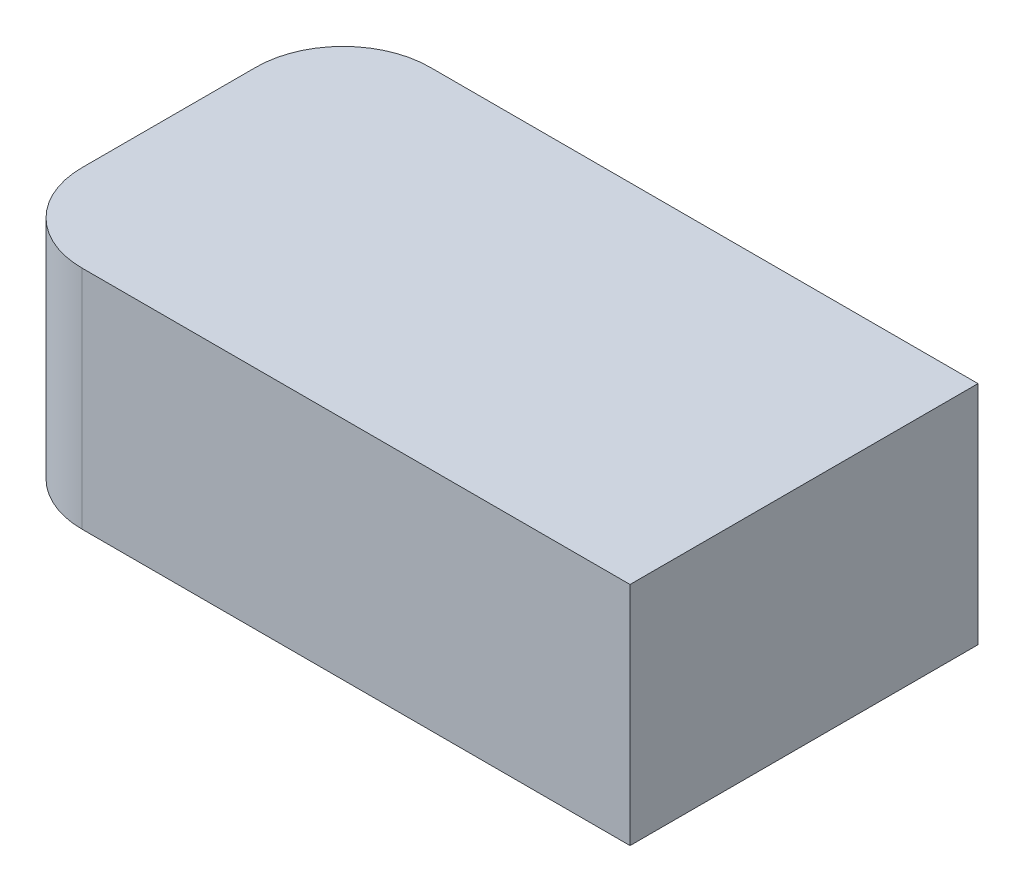
ISO-10303-21;
HEADER;
FILE_DESCRIPTION(('STEP AP214'),'2;1');
FILE_NAME('part.step','',(''),(''),'','','');
FILE_SCHEMA(('AUTOMOTIVE_DESIGN { 1 0 10303 214 1 1 1 1 }'));
ENDSEC;
DATA;
#1=APPLICATION_CONTEXT('core data for automotive mechanical design processes');
#2=APPLICATION_PROTOCOL_DEFINITION('international standard','automotive_design',2000,#1);
#3=PRODUCT_CONTEXT('',#1,'mechanical');
#4=PRODUCT('Part','Part','',(#3));
#5=PRODUCT_RELATED_PRODUCT_CATEGORY('part','',(#4));
#6=PRODUCT_DEFINITION_FORMATION('','',#4);
#7=PRODUCT_DEFINITION_CONTEXT('part definition',#1,'design');
#8=PRODUCT_DEFINITION('design','',#6,#7);
#9=PRODUCT_DEFINITION_SHAPE('','',#8);
#10=(LENGTH_UNIT() NAMED_UNIT(*) SI_UNIT(.MILLI.,.METRE.));
#11=(NAMED_UNIT(*) PLANE_ANGLE_UNIT() SI_UNIT($,.RADIAN.));
#12=(NAMED_UNIT(*) SI_UNIT($,.STERADIAN.) SOLID_ANGLE_UNIT());
#13=UNCERTAINTY_MEASURE_WITH_UNIT(LENGTH_MEASURE(1.E-05),#10,'distance_accuracy_value','');
#14=(GEOMETRIC_REPRESENTATION_CONTEXT(3) GLOBAL_UNCERTAINTY_ASSIGNED_CONTEXT((#13)) GLOBAL_UNIT_ASSIGNED_CONTEXT((#10,
#11,#12)) REPRESENTATION_CONTEXT('',''));
#15=CARTESIAN_POINT('',(0.,0.,0.));
#16=DIRECTION('',(0.,0.,1.));
#17=DIRECTION('',(1.,0.,0.));
#18=AXIS2_PLACEMENT_3D('',#15,#16,#17);
#19=CARTESIAN_POINT('',(-0.1325,0.13,0.05));
#20=DIRECTION('',(0.,1.,0.));
#21=DIRECTION('',(0.,0.,1.));
#22=AXIS2_PLACEMENT_3D('',#19,#20,#21);
#23=PLANE('',#22);
#24=CARTESIAN_POINT('',(-0.1325,0.13,0.05));
#25=DIRECTION('',(0.,1.,0.));
#26=DIRECTION('',(0.,0.,-1.));
#27=AXIS2_PLACEMENT_3D('',#24,#25,#26);
#28=CIRCLE('',#27,0.05);
#29=CARTESIAN_POINT('',(-0.1825,0.13,0.05));
#30=VERTEX_POINT('',#29);
#31=CARTESIAN_POINT('',(-0.1325,0.13,0.1));
#32=VERTEX_POINT('',#31);
#33=EDGE_CURVE('E11',#30,#32,#28,.T.);
#34=ORIENTED_EDGE('',*,*,#33,.T.);
#35=DIRECTION('',(1.,0.,0.));
#36=VECTOR('',#35,1.);
#37=CARTESIAN_POINT('',(-0.1325,0.13,0.1));
#38=LINE('',#37,#36);
#39=CARTESIAN_POINT('',(0.1825,0.13,0.1));
#40=VERTEX_POINT('',#39);
#41=EDGE_CURVE('E25',#32,#40,#38,.T.);
#42=ORIENTED_EDGE('',*,*,#41,.T.);
#43=DIRECTION('',(0.,0.,-1.));
#44=VECTOR('',#43,1.);
#45=CARTESIAN_POINT('',(0.1825,0.13,0.05));
#46=LINE('',#45,#44);
#47=CARTESIAN_POINT('',(0.1825,0.13,-0.1));
#48=VERTEX_POINT('',#47);
#49=EDGE_CURVE('E82',#40,#48,#46,.T.);
#50=ORIENTED_EDGE('',*,*,#49,.T.);
#51=DIRECTION('',(-1.,0.,0.));
#52=VECTOR('',#51,1.);
#53=CARTESIAN_POINT('',(-0.1325,0.13,-0.1));
#54=LINE('',#53,#52);
#55=CARTESIAN_POINT('',(-0.1325,0.13,-0.1));
#56=VERTEX_POINT('',#55);
#57=EDGE_CURVE('E118',#48,#56,#54,.T.);
#58=ORIENTED_EDGE('',*,*,#57,.T.);
#59=CARTESIAN_POINT('',(-0.1325,0.13,-0.05));
#60=DIRECTION('',(0.,1.,0.));
#61=DIRECTION('',(0.,0.,-1.));
#62=AXIS2_PLACEMENT_3D('',#59,#60,#61);
#63=CIRCLE('',#62,0.05);
#64=CARTESIAN_POINT('',(-0.1825,0.13,-0.05));
#65=VERTEX_POINT('',#64);
#66=EDGE_CURVE('E114',#56,#65,#63,.T.);
#67=ORIENTED_EDGE('',*,*,#66,.T.);
#68=DIRECTION('',(0.,0.,1.));
#69=VECTOR('',#68,1.);
#70=CARTESIAN_POINT('',(-0.1825,0.13,0.05));
#71=LINE('',#70,#69);
#72=EDGE_CURVE('E110',#65,#30,#71,.T.);
#73=ORIENTED_EDGE('',*,*,#72,.T.);
#74=EDGE_LOOP('',(#34,#42,#50,#58,#67,#73));
#75=FACE_BOUND('',#74,.T.);
#76=ADVANCED_FACE('F17',(#75),#23,.T.);
#77=CARTESIAN_POINT('',(-0.1825,0.13,-0.05));
#78=DIRECTION('',(1.,0.,0.));
#79=DIRECTION('',(0.,0.,-1.));
#80=AXIS2_PLACEMENT_3D('',#77,#78,#79);
#81=PLANE('',#80);
#82=DIRECTION('',(0.,-1.,0.));
#83=VECTOR('',#82,1.);
#84=CARTESIAN_POINT('',(-0.1825,0.13,0.05));
#85=LINE('',#84,#83);
#86=CARTESIAN_POINT('',(-0.1825,0.,0.05));
#87=VERTEX_POINT('',#86);
#88=EDGE_CURVE('E105',#30,#87,#85,.T.);
#89=ORIENTED_EDGE('',*,*,#88,.F.);
#90=ORIENTED_EDGE('',*,*,#72,.F.);
#91=DIRECTION('',(0.,1.,0.));
#92=VECTOR('',#91,1.);
#93=CARTESIAN_POINT('',(-0.1825,0.13,-0.05));
#94=LINE('',#93,#92);
#95=CARTESIAN_POINT('',(-0.1825,0.,-0.05));
#96=VERTEX_POINT('',#95);
#97=EDGE_CURVE('E92',#96,#65,#94,.T.);
#98=ORIENTED_EDGE('',*,*,#97,.F.);
#99=DIRECTION('',(0.,0.,-1.));
#100=VECTOR('',#99,1.);
#101=CARTESIAN_POINT('',(-0.1825,0.,-0.05));
#102=LINE('',#101,#100);
#103=EDGE_CURVE('E88',#87,#96,#102,.T.);
#104=ORIENTED_EDGE('',*,*,#103,.F.);
#105=EDGE_LOOP('',(#89,#90,#98,#104));
#106=FACE_BOUND('',#105,.T.);
#107=ADVANCED_FACE('F144',(#106),#81,.F.);
#108=CARTESIAN_POINT('',(-0.1325,0.,0.05));
#109=DIRECTION('',(0.,1.,0.));
#110=DIRECTION('',(0.,0.,1.));
#111=AXIS2_PLACEMENT_3D('',#108,#109,#110);
#112=PLANE('',#111);
#113=DIRECTION('',(-1.,0.,0.));
#114=VECTOR('',#113,1.);
#115=CARTESIAN_POINT('',(-0.1325,0.,0.1));
#116=LINE('',#115,#114);
#117=CARTESIAN_POINT('',(0.1825,0.,0.1));
#118=VERTEX_POINT('',#117);
#119=CARTESIAN_POINT('',(-0.1325,0.,0.1));
#120=VERTEX_POINT('',#119);
#121=EDGE_CURVE('E70',#118,#120,#116,.T.);
#122=ORIENTED_EDGE('',*,*,#121,.T.);
#123=CARTESIAN_POINT('',(-0.1325,0.,0.05));
#124=DIRECTION('',(0.,1.,0.));
#125=DIRECTION('',(0.,0.,-1.));
#126=AXIS2_PLACEMENT_3D('',#123,#124,#125);
#127=CIRCLE('',#126,0.05);
#128=EDGE_CURVE('E89',#87,#120,#127,.T.);
#129=ORIENTED_EDGE('',*,*,#128,.F.);
#130=ORIENTED_EDGE('',*,*,#103,.T.);
#131=CARTESIAN_POINT('',(-0.1325,0.,-0.05));
#132=DIRECTION('',(0.,1.,0.));
#133=DIRECTION('',(0.,0.,-1.));
#134=AXIS2_PLACEMENT_3D('',#131,#132,#133);
#135=CIRCLE('',#134,0.05);
#136=CARTESIAN_POINT('',(-0.1325,0.,-0.1));
#137=VERTEX_POINT('',#136);
#138=EDGE_CURVE('E94',#137,#96,#135,.T.);
#139=ORIENTED_EDGE('',*,*,#138,.F.);
#140=DIRECTION('',(1.,0.,0.));
#141=VECTOR('',#140,1.);
#142=CARTESIAN_POINT('',(-0.1325,0.,-0.1));
#143=LINE('',#142,#141);
#144=CARTESIAN_POINT('',(0.1825,0.,-0.1));
#145=VERTEX_POINT('',#144);
#146=EDGE_CURVE('E73',#137,#145,#143,.T.);
#147=ORIENTED_EDGE('',*,*,#146,.T.);
#148=DIRECTION('',(0.,0.,1.));
#149=VECTOR('',#148,1.);
#150=CARTESIAN_POINT('',(0.1825,0.,-0.1));
#151=LINE('',#150,#149);
#152=EDGE_CURVE('E65',#145,#118,#151,.T.);
#153=ORIENTED_EDGE('',*,*,#152,.T.);
#154=EDGE_LOOP('',(#122,#129,#130,#139,#147,#153));
#155=FACE_BOUND('',#154,.T.);
#156=ADVANCED_FACE('F67',(#155),#112,.F.);
#157=CARTESIAN_POINT('',(0.1825,0.13,-0.1));
#158=DIRECTION('',(-1.,0.,0.));
#159=DIRECTION('',(0.,0.,1.));
#160=AXIS2_PLACEMENT_3D('',#157,#158,#159);
#161=PLANE('',#160);
#162=DIRECTION('',(0.,1.,0.));
#163=VECTOR('',#162,1.);
#164=CARTESIAN_POINT('',(0.1825,0.13,-0.1));
#165=LINE('',#164,#163);
#166=EDGE_CURVE('E77',#145,#48,#165,.T.);
#167=ORIENTED_EDGE('',*,*,#166,.T.);
#168=ORIENTED_EDGE('',*,*,#49,.F.);
#169=DIRECTION('',(0.,-1.,0.));
#170=VECTOR('',#169,1.);
#171=CARTESIAN_POINT('',(0.1825,0.13,0.1));
#172=LINE('',#171,#170);
#173=EDGE_CURVE('E80',#40,#118,#172,.T.);
#174=ORIENTED_EDGE('',*,*,#173,.T.);
#175=ORIENTED_EDGE('',*,*,#152,.F.);
#176=EDGE_LOOP('',(#167,#168,#174,#175));
#177=FACE_BOUND('',#176,.T.);
#178=ADVANCED_FACE('F81',(#177),#161,.F.);
#179=CARTESIAN_POINT('',(-0.1325,0.13,0.1));
#180=DIRECTION('',(0.,0.,-1.));
#181=DIRECTION('',(-1.,0.,0.));
#182=AXIS2_PLACEMENT_3D('',#179,#180,#181);
#183=PLANE('',#182);
#184=ORIENTED_EDGE('',*,*,#173,.F.);
#185=ORIENTED_EDGE('',*,*,#41,.F.);
#186=DIRECTION('',(0.,1.,0.));
#187=VECTOR('',#186,1.);
#188=CARTESIAN_POINT('',(-0.1325,0.13,0.1));
#189=LINE('',#188,#187);
#190=EDGE_CURVE('E84',#120,#32,#189,.T.);
#191=ORIENTED_EDGE('',*,*,#190,.F.);
#192=ORIENTED_EDGE('',*,*,#121,.F.);
#193=EDGE_LOOP('',(#184,#185,#191,#192));
#194=FACE_BOUND('',#193,.T.);
#195=ADVANCED_FACE('F86',(#194),#183,.F.);
#196=CARTESIAN_POINT('',(-0.1325,0.13,0.05));
#197=DIRECTION('',(0.,-1.,0.));
#198=DIRECTION('',(0.707106781186548,0.,-0.707106781186548));
#199=AXIS2_PLACEMENT_3D('',#196,#197,#198);
#200=CYLINDRICAL_SURFACE('',#199,0.05);
#201=ORIENTED_EDGE('',*,*,#33,.F.);
#202=ORIENTED_EDGE('',*,*,#88,.T.);
#203=ORIENTED_EDGE('',*,*,#128,.T.);
#204=ORIENTED_EDGE('',*,*,#190,.T.);
#205=EDGE_LOOP('',(#201,#202,#203,#204));
#206=FACE_BOUND('',#205,.T.);
#207=ADVANCED_FACE('F146',(#206),#200,.T.);
#208=CARTESIAN_POINT('',(-0.1325,0.13,-0.1));
#209=DIRECTION('',(0.,0.,1.));
#210=DIRECTION('',(1.,0.,0.));
#211=AXIS2_PLACEMENT_3D('',#208,#209,#210);
#212=PLANE('',#211);
#213=DIRECTION('',(0.,-1.,0.));
#214=VECTOR('',#213,1.);
#215=CARTESIAN_POINT('',(-0.1325,0.13,-0.1));
#216=LINE('',#215,#214);
#217=EDGE_CURVE('E135',#56,#137,#216,.T.);
#218=ORIENTED_EDGE('',*,*,#217,.F.);
#219=ORIENTED_EDGE('',*,*,#57,.F.);
#220=ORIENTED_EDGE('',*,*,#166,.F.);
#221=ORIENTED_EDGE('',*,*,#146,.F.);
#222=EDGE_LOOP('',(#218,#219,#220,#221));
#223=FACE_BOUND('',#222,.T.);
#224=ADVANCED_FACE('F133',(#223),#212,.F.);
#225=CARTESIAN_POINT('',(-0.1325,0.13,-0.05));
#226=DIRECTION('',(0.,-1.,0.));
#227=DIRECTION('',(0.707106781186548,0.,0.707106781186547));
#228=AXIS2_PLACEMENT_3D('',#225,#226,#227);
#229=CYLINDRICAL_SURFACE('',#228,0.05);
#230=ORIENTED_EDGE('',*,*,#66,.F.);
#231=ORIENTED_EDGE('',*,*,#217,.T.);
#232=ORIENTED_EDGE('',*,*,#138,.T.);
#233=ORIENTED_EDGE('',*,*,#97,.T.);
#234=EDGE_LOOP('',(#230,#231,#232,#233));
#235=FACE_BOUND('',#234,.T.);
#236=ADVANCED_FACE('F140',(#235),#229,.T.);
#237=CLOSED_SHELL('',(#76,#107,#156,#178,#195,#207,#224,#236));
#238=MANIFOLD_SOLID_BREP('B1',#237);
#239=ADVANCED_BREP_SHAPE_REPRESENTATION('',(#18,#238),#14);
#240=SHAPE_DEFINITION_REPRESENTATION(#9,#239);
ENDSEC;
END-ISO-10303-21;
